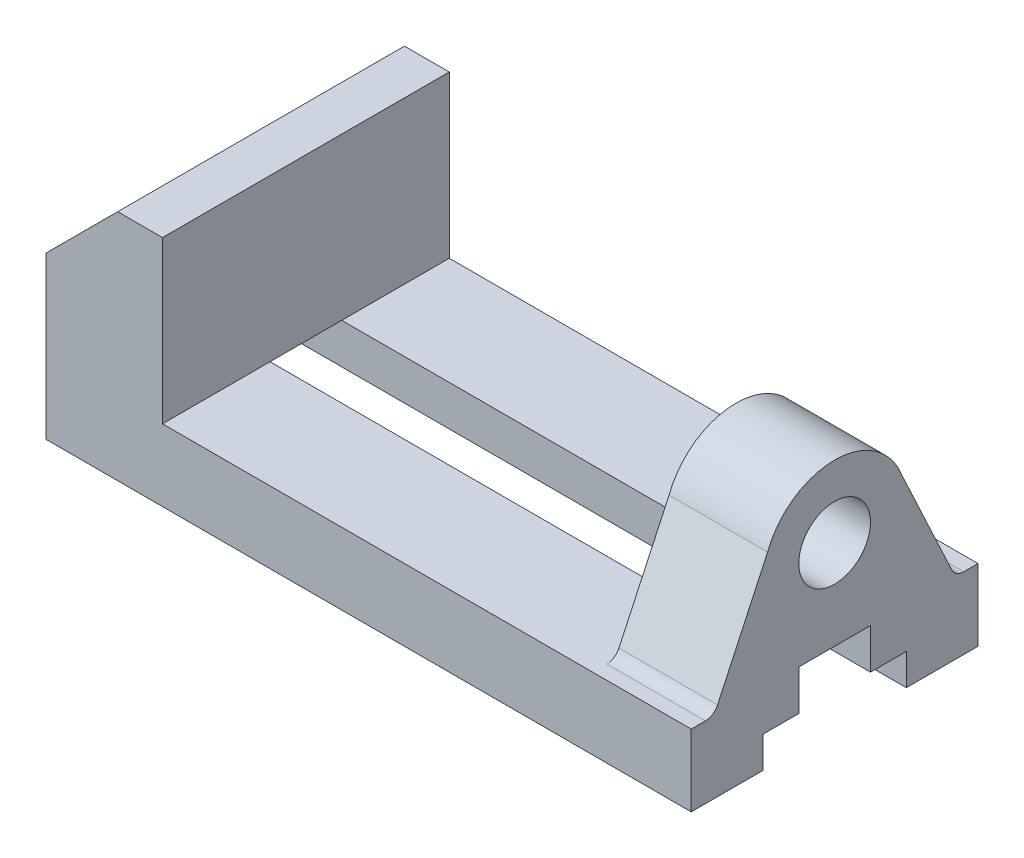
ISO-10303-21;
HEADER;
FILE_DESCRIPTION(('STEP AP214'),'2;1');
FILE_NAME('part.step','',(''),(''),'','','');
FILE_SCHEMA(('AUTOMOTIVE_DESIGN { 1 0 10303 214 1 1 1 1 }'));
ENDSEC;
DATA;
#1=APPLICATION_CONTEXT('core data for automotive mechanical design processes');
#2=APPLICATION_PROTOCOL_DEFINITION('international standard','automotive_design',2000,#1);
#3=PRODUCT_CONTEXT('',#1,'mechanical');
#4=PRODUCT('Part','Part','',(#3));
#5=PRODUCT_RELATED_PRODUCT_CATEGORY('part','',(#4));
#6=PRODUCT_DEFINITION_FORMATION('','',#4);
#7=PRODUCT_DEFINITION_CONTEXT('part definition',#1,'design');
#8=PRODUCT_DEFINITION('design','',#6,#7);
#9=PRODUCT_DEFINITION_SHAPE('','',#8);
#10=(LENGTH_UNIT() NAMED_UNIT(*) SI_UNIT(.MILLI.,.METRE.));
#11=(NAMED_UNIT(*) PLANE_ANGLE_UNIT() SI_UNIT($,.RADIAN.));
#12=(NAMED_UNIT(*) SI_UNIT($,.STERADIAN.) SOLID_ANGLE_UNIT());
#13=UNCERTAINTY_MEASURE_WITH_UNIT(LENGTH_MEASURE(1.E-05),#10,'distance_accuracy_value','');
#14=(GEOMETRIC_REPRESENTATION_CONTEXT(3) GLOBAL_UNCERTAINTY_ASSIGNED_CONTEXT((#13)) GLOBAL_UNIT_ASSIGNED_CONTEXT((#10,
#11,#12)) REPRESENTATION_CONTEXT('',''));
#15=CARTESIAN_POINT('',(0.,0.,0.));
#16=DIRECTION('',(0.,0.,1.));
#17=DIRECTION('',(1.,0.,0.));
#18=AXIS2_PLACEMENT_3D('',#15,#16,#17);
#19=CARTESIAN_POINT('',(50.,52.,-32.));
#20=DIRECTION('',(1.,0.,0.));
#21=DIRECTION('',(0.,0.,-1.));
#22=AXIS2_PLACEMENT_3D('',#19,#20,#21);
#23=PLANE('',#22);
#24=CARTESIAN_POINT('',(50.,36.,0.));
#25=DIRECTION('',(1.,0.,0.));
#26=DIRECTION('',(0.,0.,-1.));
#27=AXIS2_PLACEMENT_3D('',#24,#25,#26);
#28=CIRCLE('',#27,8.);
#29=CARTESIAN_POINT('',(50.,36.,-8.));
#30=VERTEX_POINT('',#29);
#31=EDGE_CURVE('E295',#30,#30,#28,.T.);
#32=ORIENTED_EDGE('',*,*,#31,.T.);
#33=EDGE_LOOP('',(#32));
#34=FACE_BOUND('',#33,.T.);
#35=CARTESIAN_POINT('',(50.,36.,0.));
#36=DIRECTION('',(1.,0.,0.));
#37=DIRECTION('',(0.,0.,-1.));
#38=AXIS2_PLACEMENT_3D('',#35,#36,#37);
#39=CIRCLE('',#38,16.);
#40=CARTESIAN_POINT('',(50.,41.678448811135,-14.9584497558845));
#41=VERTEX_POINT('',#40);
#42=CARTESIAN_POINT('',(50.,41.678448811135,14.9584497558845));
#43=VERTEX_POINT('',#42);
#44=EDGE_CURVE('E319',#41,#43,#39,.T.);
#45=ORIENTED_EDGE('',*,*,#44,.F.);
#46=DIRECTION('',(0.,0.90630778703665,0.4226182617407));
#47=VECTOR('',#46,1.);
#48=CARTESIAN_POINT('',(50.,43.6292145807226,-14.0487927382591));
#49=LINE('',#48,#47);
#50=CARTESIAN_POINT('',(50.,17.7321452147779,-26.1247945073704));
#51=VERTEX_POINT('',#50);
#52=EDGE_CURVE('E301',#51,#41,#49,.T.);
#53=ORIENTED_EDGE('',*,*,#52,.F.);
#54=CARTESIAN_POINT('',(50.,19.,-28.8437178684803));
#55=DIRECTION('',(1.,0.,0.));
#56=DIRECTION('',(0.,0.,-1.));
#57=AXIS2_PLACEMENT_3D('',#54,#55,#56);
#58=CIRCLE('',#57,3.);
#59=CARTESIAN_POINT('',(50.,16.,-28.8437178684803));
#60=VERTEX_POINT('',#59);
#61=EDGE_CURVE('E298',#51,#60,#58,.T.);
#62=ORIENTED_EDGE('',*,*,#61,.T.);
#63=DIRECTION('',(0.,0.,1.));
#64=VECTOR('',#63,1.);
#65=CARTESIAN_POINT('',(50.,16.,-32.));
#66=LINE('',#65,#64);
#67=CARTESIAN_POINT('',(50.,16.,-8.));
#68=VERTEX_POINT('',#67);
#69=EDGE_CURVE('E369',#60,#68,#66,.T.);
#70=ORIENTED_EDGE('',*,*,#69,.T.);
#71=CARTESIAN_POINT('',(50.,16.,8.));
#72=VERTEX_POINT('',#71);
#73=EDGE_CURVE('E372',#68,#72,#66,.T.);
#74=ORIENTED_EDGE('',*,*,#73,.T.);
#75=CARTESIAN_POINT('',(50.,16.,28.8437178684803));
#76=VERTEX_POINT('',#75);
#77=EDGE_CURVE('E368',#72,#76,#66,.T.);
#78=ORIENTED_EDGE('',*,*,#77,.T.);
#79=CARTESIAN_POINT('',(50.,19.,28.8437178684803));
#80=DIRECTION('',(1.,0.,0.));
#81=DIRECTION('',(0.,0.,-1.));
#82=AXIS2_PLACEMENT_3D('',#79,#80,#81);
#83=CIRCLE('',#82,3.);
#84=CARTESIAN_POINT('',(50.,17.7321452147779,26.1247945073703));
#85=VERTEX_POINT('',#84);
#86=EDGE_CURVE('E83',#76,#85,#83,.T.);
#87=ORIENTED_EDGE('',*,*,#86,.T.);
#88=DIRECTION('',(0.,0.90630778703665,-0.4226182617407));
#89=VECTOR('',#88,1.);
#90=CARTESIAN_POINT('',(50.,68.1426367605299,2.61799624822837));
#91=LINE('',#90,#89);
#92=EDGE_CURVE('E12',#85,#43,#91,.T.);
#93=ORIENTED_EDGE('',*,*,#92,.T.);
#94=EDGE_LOOP('',(#45,#53,#62,#70,#74,#78,#87,#93));
#95=FACE_BOUND('',#94,.T.);
#96=ADVANCED_FACE('F75',(#34,#95),#23,.F.);
#97=CARTESIAN_POINT('',(72.,16.,-32.));
#98=DIRECTION('',(-1.,0.,0.));
#99=DIRECTION('',(0.,0.,1.));
#100=AXIS2_PLACEMENT_3D('',#97,#98,#99);
#101=PLANE('',#100);
#102=CARTESIAN_POINT('',(72.,36.,0.));
#103=DIRECTION('',(1.,0.,0.));
#104=DIRECTION('',(0.,0.,-1.));
#105=AXIS2_PLACEMENT_3D('',#102,#103,#104);
#106=CIRCLE('',#105,8.);
#107=CARTESIAN_POINT('',(72.,36.,-8.));
#108=VERTEX_POINT('',#107);
#109=EDGE_CURVE('E289',#108,#108,#106,.T.);
#110=ORIENTED_EDGE('',*,*,#109,.F.);
#111=EDGE_LOOP('',(#110));
#112=FACE_BOUND('',#111,.T.);
#113=DIRECTION('',(0.,0.90630778703665,0.4226182617407));
#114=VECTOR('',#113,1.);
#115=CARTESIAN_POINT('',(72.,13.1734478187763,-28.2505500143372));
#116=LINE('',#115,#114);
#117=CARTESIAN_POINT('',(72.,17.7321452147779,-26.1247945073704));
#118=VERTEX_POINT('',#117);
#119=CARTESIAN_POINT('',(72.,41.678448811135,-14.9584497558845));
#120=VERTEX_POINT('',#119);
#121=EDGE_CURVE('E276',#118,#120,#116,.T.);
#122=ORIENTED_EDGE('',*,*,#121,.T.);
#123=CARTESIAN_POINT('',(72.,36.,0.));
#124=DIRECTION('',(1.,0.,0.));
#125=DIRECTION('',(0.,0.,-1.));
#126=AXIS2_PLACEMENT_3D('',#123,#124,#125);
#127=CIRCLE('',#126,16.);
#128=CARTESIAN_POINT('',(72.,41.678448811135,14.9584497558845));
#129=VERTEX_POINT('',#128);
#130=EDGE_CURVE('E313',#120,#129,#127,.T.);
#131=ORIENTED_EDGE('',*,*,#130,.T.);
#132=DIRECTION('',(0.,0.90630778703665,-0.4226182617407));
#133=VECTOR('',#132,1.);
#134=CARTESIAN_POINT('',(72.,13.1734478187762,28.2505500143372));
#135=LINE('',#134,#133);
#136=CARTESIAN_POINT('',(72.,17.7321452147779,26.1247945073703));
#137=VERTEX_POINT('',#136);
#138=EDGE_CURVE('E310',#137,#129,#135,.T.);
#139=ORIENTED_EDGE('',*,*,#138,.F.);
#140=CARTESIAN_POINT('',(72.,19.,28.8437178684803));
#141=DIRECTION('',(1.,0.,0.));
#142=DIRECTION('',(0.,0.,-1.));
#143=AXIS2_PLACEMENT_3D('',#140,#141,#142);
#144=CIRCLE('',#143,3.);
#145=CARTESIAN_POINT('',(72.,16.,28.8437178684803));
#146=VERTEX_POINT('',#145);
#147=EDGE_CURVE('E307',#146,#137,#144,.T.);
#148=ORIENTED_EDGE('',*,*,#147,.F.);
#149=DIRECTION('',(0.,0.,-1.));
#150=VECTOR('',#149,1.);
#151=CARTESIAN_POINT('',(72.,16.,0.));
#152=LINE('',#151,#150);
#153=CARTESIAN_POINT('',(72.,16.,32.));
#154=VERTEX_POINT('',#153);
#155=EDGE_CURVE('E304',#154,#146,#152,.T.);
#156=ORIENTED_EDGE('',*,*,#155,.F.);
#157=DIRECTION('',(0.,-1.,0.));
#158=VECTOR('',#157,1.);
#159=CARTESIAN_POINT('',(72.,16.,32.));
#160=LINE('',#159,#158);
#161=CARTESIAN_POINT('',(72.,0.,32.));
#162=VERTEX_POINT('',#161);
#163=EDGE_CURVE('E404',#154,#162,#160,.T.);
#164=ORIENTED_EDGE('',*,*,#163,.T.);
#165=DIRECTION('',(0.,0.,-1.));
#166=VECTOR('',#165,1.);
#167=CARTESIAN_POINT('',(72.,0.,-32.));
#168=LINE('',#167,#166);
#169=CARTESIAN_POINT('',(72.,0.,16.));
#170=VERTEX_POINT('',#169);
#171=EDGE_CURVE('E405',#162,#170,#168,.T.);
#172=ORIENTED_EDGE('',*,*,#171,.T.);
#173=DIRECTION('',(0.,-1.,0.));
#174=VECTOR('',#173,1.);
#175=CARTESIAN_POINT('',(72.,16.,16.));
#176=LINE('',#175,#174);
#177=CARTESIAN_POINT('',(72.,7.,16.));
#178=VERTEX_POINT('',#177);
#179=EDGE_CURVE('E90',#178,#170,#176,.T.);
#180=ORIENTED_EDGE('',*,*,#179,.F.);
#181=DIRECTION('',(0.,0.,1.));
#182=VECTOR('',#181,1.);
#183=CARTESIAN_POINT('',(72.,7.,-32.));
#184=LINE('',#183,#182);
#185=CARTESIAN_POINT('',(72.,7.,8.));
#186=VERTEX_POINT('',#185);
#187=EDGE_CURVE('E431',#186,#178,#184,.T.);
#188=ORIENTED_EDGE('',*,*,#187,.F.);
#189=DIRECTION('',(0.,-1.,0.));
#190=VECTOR('',#189,1.);
#191=CARTESIAN_POINT('',(72.,16.,8.));
#192=LINE('',#191,#190);
#193=CARTESIAN_POINT('',(72.,16.,8.));
#194=VERTEX_POINT('',#193);
#195=EDGE_CURVE('E429',#194,#186,#192,.T.);
#196=ORIENTED_EDGE('',*,*,#195,.F.);
#197=DIRECTION('',(0.,0.,1.));
#198=VECTOR('',#197,1.);
#199=CARTESIAN_POINT('',(72.,16.,-32.));
#200=LINE('',#199,#198);
#201=CARTESIAN_POINT('',(72.,16.,-8.));
#202=VERTEX_POINT('',#201);
#203=EDGE_CURVE('E363',#202,#194,#200,.T.);
#204=ORIENTED_EDGE('',*,*,#203,.F.);
#205=DIRECTION('',(0.,1.,0.));
#206=VECTOR('',#205,1.);
#207=CARTESIAN_POINT('',(72.,16.,-8.));
#208=LINE('',#207,#206);
#209=CARTESIAN_POINT('',(72.,7.,-8.));
#210=VERTEX_POINT('',#209);
#211=EDGE_CURVE('E427',#210,#202,#208,.T.);
#212=ORIENTED_EDGE('',*,*,#211,.F.);
#213=DIRECTION('',(0.,0.,1.));
#214=VECTOR('',#213,1.);
#215=CARTESIAN_POINT('',(72.,7.,-32.));
#216=LINE('',#215,#214);
#217=CARTESIAN_POINT('',(72.,7.,-16.));
#218=VERTEX_POINT('',#217);
#219=EDGE_CURVE('E425',#218,#210,#216,.T.);
#220=ORIENTED_EDGE('',*,*,#219,.F.);
#221=DIRECTION('',(0.,1.,0.));
#222=VECTOR('',#221,1.);
#223=CARTESIAN_POINT('',(72.,16.,-16.));
#224=LINE('',#223,#222);
#225=CARTESIAN_POINT('',(72.,0.,-16.));
#226=VERTEX_POINT('',#225);
#227=EDGE_CURVE('E366',#226,#218,#224,.T.);
#228=ORIENTED_EDGE('',*,*,#227,.F.);
#229=CARTESIAN_POINT('',(72.,0.,-32.));
#230=VERTEX_POINT('',#229);
#231=EDGE_CURVE('E398',#226,#230,#168,.T.);
#232=ORIENTED_EDGE('',*,*,#231,.T.);
#233=DIRECTION('',(0.,-1.,0.));
#234=VECTOR('',#233,1.);
#235=CARTESIAN_POINT('',(72.,16.,-32.));
#236=LINE('',#235,#234);
#237=CARTESIAN_POINT('',(72.,16.,-32.));
#238=VERTEX_POINT('',#237);
#239=EDGE_CURVE('E423',#238,#230,#236,.T.);
#240=ORIENTED_EDGE('',*,*,#239,.F.);
#241=DIRECTION('',(0.,0.,-1.));
#242=VECTOR('',#241,1.);
#243=CARTESIAN_POINT('',(72.,16.,0.));
#244=LINE('',#243,#242);
#245=CARTESIAN_POINT('',(72.,16.,-28.8437178684803));
#246=VERTEX_POINT('',#245);
#247=EDGE_CURVE('E282',#246,#238,#244,.T.);
#248=ORIENTED_EDGE('',*,*,#247,.F.);
#249=CARTESIAN_POINT('',(72.,19.,-28.8437178684803));
#250=DIRECTION('',(1.,0.,0.));
#251=DIRECTION('',(0.,0.,-1.));
#252=AXIS2_PLACEMENT_3D('',#249,#250,#251);
#253=CIRCLE('',#252,3.);
#254=EDGE_CURVE('E279',#118,#246,#253,.T.);
#255=ORIENTED_EDGE('',*,*,#254,.F.);
#256=EDGE_LOOP('',(#122,#131,#139,#148,#156,#164,#172,#180,#188,#196,#204,#212,#220,#228,#232,
#240,#248,#255));
#257=FACE_BOUND('',#256,.T.);
#258=ADVANCED_FACE('F77',(#112,#257),#101,.F.);
#259=CARTESIAN_POINT('',(0.,16.,0.));
#260=DIRECTION('',(0.,1.,0.));
#261=DIRECTION('',(0.,0.,1.));
#262=AXIS2_PLACEMENT_3D('',#259,#260,#261);
#263=PLANE('',#262);
#264=DIRECTION('',(1.,0.,0.));
#265=VECTOR('',#264,1.);
#266=CARTESIAN_POINT('',(36.,16.,28.8437178684803));
#267=LINE('',#266,#265);
#268=EDGE_CURVE('E316',#76,#146,#267,.T.);
#269=ORIENTED_EDGE('',*,*,#268,.F.);
#270=ORIENTED_EDGE('',*,*,#77,.F.);
#271=DIRECTION('',(1.,0.,0.));
#272=VECTOR('',#271,1.);
#273=CARTESIAN_POINT('',(-72.,16.,8.));
#274=LINE('',#273,#272);
#275=CARTESIAN_POINT('',(-46.,16.,8.));
#276=VERTEX_POINT('',#275);
#277=EDGE_CURVE('E98',#276,#72,#274,.T.);
#278=ORIENTED_EDGE('',*,*,#277,.F.);
#279=DIRECTION('',(0.,0.,-1.));
#280=VECTOR('',#279,1.);
#281=CARTESIAN_POINT('',(-46.,16.,-32.));
#282=LINE('',#281,#280);
#283=CARTESIAN_POINT('',(-46.,16.,32.));
#284=VERTEX_POINT('',#283);
#285=EDGE_CURVE('E385',#284,#276,#282,.T.);
#286=ORIENTED_EDGE('',*,*,#285,.F.);
#287=DIRECTION('',(1.,0.,0.));
#288=VECTOR('',#287,1.);
#289=CARTESIAN_POINT('',(-72.,16.,32.));
#290=LINE('',#289,#288);
#291=EDGE_CURVE('E401',#284,#154,#290,.T.);
#292=ORIENTED_EDGE('',*,*,#291,.T.);
#293=ORIENTED_EDGE('',*,*,#155,.T.);
#294=EDGE_LOOP('',(#269,#270,#278,#286,#292,#293));
#295=FACE_BOUND('',#294,.T.);
#296=ADVANCED_FACE('F442',(#295),#263,.T.);
#297=ORIENTED_EDGE('',*,*,#69,.F.);
#298=DIRECTION('',(1.,0.,0.));
#299=VECTOR('',#298,1.);
#300=CARTESIAN_POINT('',(36.,16.,-28.8437178684803));
#301=LINE('',#300,#299);
#302=EDGE_CURVE('E290',#60,#246,#301,.T.);
#303=ORIENTED_EDGE('',*,*,#302,.T.);
#304=ORIENTED_EDGE('',*,*,#247,.T.);
#305=DIRECTION('',(-1.,0.,0.));
#306=VECTOR('',#305,1.);
#307=CARTESIAN_POINT('',(-72.,16.,-32.));
#308=LINE('',#307,#306);
#309=CARTESIAN_POINT('',(-46.,16.,-32.));
#310=VERTEX_POINT('',#309);
#311=EDGE_CURVE('E399',#238,#310,#308,.T.);
#312=ORIENTED_EDGE('',*,*,#311,.T.);
#313=CARTESIAN_POINT('',(-46.,16.,-8.));
#314=VERTEX_POINT('',#313);
#315=EDGE_CURVE('E381',#314,#310,#282,.T.);
#316=ORIENTED_EDGE('',*,*,#315,.F.);
#317=DIRECTION('',(1.,0.,0.));
#318=VECTOR('',#317,1.);
#319=CARTESIAN_POINT('',(-72.,16.,-8.));
#320=LINE('',#319,#318);
#321=EDGE_CURVE('E355',#314,#68,#320,.T.);
#322=ORIENTED_EDGE('',*,*,#321,.T.);
#323=EDGE_LOOP('',(#297,#303,#304,#312,#316,#322));
#324=FACE_BOUND('',#323,.T.);
#325=ADVANCED_FACE('F468',(#324),#263,.T.);
#326=CARTESIAN_POINT('',(-72.,16.,-32.));
#327=DIRECTION('',(1.,0.,0.));
#328=DIRECTION('',(0.,0.,-1.));
#329=AXIS2_PLACEMENT_3D('',#326,#327,#328);
#330=PLANE('',#329);
#331=DIRECTION('',(0.,-1.,0.));
#332=VECTOR('',#331,1.);
#333=CARTESIAN_POINT('',(-72.,0.,-16.));
#334=LINE('',#333,#332);
#335=CARTESIAN_POINT('',(-72.,7.,-16.));
#336=VERTEX_POINT('',#335);
#337=CARTESIAN_POINT('',(-72.,0.,-16.));
#338=VERTEX_POINT('',#337);
#339=EDGE_CURVE('E324',#336,#338,#334,.T.);
#340=ORIENTED_EDGE('',*,*,#339,.F.);
#341=DIRECTION('',(0.,0.,-1.));
#342=VECTOR('',#341,1.);
#343=CARTESIAN_POINT('',(-72.,7.,0.));
#344=LINE('',#343,#342);
#345=CARTESIAN_POINT('',(-72.,7.,-8.));
#346=VERTEX_POINT('',#345);
#347=EDGE_CURVE('E326',#346,#336,#344,.T.);
#348=ORIENTED_EDGE('',*,*,#347,.F.);
#349=DIRECTION('',(0.,-1.,0.));
#350=VECTOR('',#349,1.);
#351=CARTESIAN_POINT('',(-72.,0.,-8.));
#352=LINE('',#351,#350);
#353=CARTESIAN_POINT('',(-72.,16.,-8.));
#354=VERTEX_POINT('',#353);
#355=EDGE_CURVE('E328',#354,#346,#352,.T.);
#356=ORIENTED_EDGE('',*,*,#355,.F.);
#357=DIRECTION('',(0.,0.,-1.));
#358=VECTOR('',#357,1.);
#359=CARTESIAN_POINT('',(-72.,16.,0.));
#360=LINE('',#359,#358);
#361=CARTESIAN_POINT('',(-72.,16.,8.));
#362=VERTEX_POINT('',#361);
#363=EDGE_CURVE('E330',#362,#354,#360,.T.);
#364=ORIENTED_EDGE('',*,*,#363,.F.);
#365=DIRECTION('',(0.,1.,0.));
#366=VECTOR('',#365,1.);
#367=CARTESIAN_POINT('',(-72.,0.,8.));
#368=LINE('',#367,#366);
#369=CARTESIAN_POINT('',(-72.,7.,8.));
#370=VERTEX_POINT('',#369);
#371=EDGE_CURVE('E332',#370,#362,#368,.T.);
#372=ORIENTED_EDGE('',*,*,#371,.F.);
#373=DIRECTION('',(0.,0.,-1.));
#374=VECTOR('',#373,1.);
#375=CARTESIAN_POINT('',(-72.,7.,0.));
#376=LINE('',#375,#374);
#377=CARTESIAN_POINT('',(-72.,7.,16.));
#378=VERTEX_POINT('',#377);
#379=EDGE_CURVE('E334',#378,#370,#376,.T.);
#380=ORIENTED_EDGE('',*,*,#379,.F.);
#381=DIRECTION('',(0.,1.,0.));
#382=VECTOR('',#381,1.);
#383=CARTESIAN_POINT('',(-72.,0.,16.));
#384=LINE('',#383,#382);
#385=CARTESIAN_POINT('',(-72.,0.,16.));
#386=VERTEX_POINT('',#385);
#387=EDGE_CURVE('E336',#386,#378,#384,.T.);
#388=ORIENTED_EDGE('',*,*,#387,.F.);
#389=DIRECTION('',(0.,0.,1.));
#390=VECTOR('',#389,1.);
#391=CARTESIAN_POINT('',(-72.,0.,-32.));
#392=LINE('',#391,#390);
#393=CARTESIAN_POINT('',(-72.,0.,32.));
#394=VERTEX_POINT('',#393);
#395=EDGE_CURVE('E411',#386,#394,#392,.T.);
#396=ORIENTED_EDGE('',*,*,#395,.T.);
#397=DIRECTION('',(0.,-1.,0.));
#398=VECTOR('',#397,1.);
#399=CARTESIAN_POINT('',(-72.,16.,32.));
#400=LINE('',#399,#398);
#401=CARTESIAN_POINT('',(-72.,35.9999999999997,32.));
#402=VERTEX_POINT('',#401);
#403=EDGE_CURVE('E418',#402,#394,#400,.T.);
#404=ORIENTED_EDGE('',*,*,#403,.F.);
#405=DIRECTION('',(0.,0.,1.));
#406=VECTOR('',#405,1.);
#407=CARTESIAN_POINT('',(-72.,35.9999999999997,-32.));
#408=LINE('',#407,#406);
#409=CARTESIAN_POINT('',(-72.,35.9999999999997,-32.));
#410=VERTEX_POINT('',#409);
#411=EDGE_CURVE('E375',#410,#402,#408,.T.);
#412=ORIENTED_EDGE('',*,*,#411,.F.);
#413=DIRECTION('',(0.,-1.,0.));
#414=VECTOR('',#413,1.);
#415=CARTESIAN_POINT('',(-72.,16.,-32.));
#416=LINE('',#415,#414);
#417=CARTESIAN_POINT('',(-72.,0.,-32.));
#418=VERTEX_POINT('',#417);
#419=EDGE_CURVE('E421',#410,#418,#416,.T.);
#420=ORIENTED_EDGE('',*,*,#419,.T.);
#421=EDGE_CURVE('E412',#418,#338,#392,.T.);
#422=ORIENTED_EDGE('',*,*,#421,.T.);
#423=EDGE_LOOP('',(#340,#348,#356,#364,#372,#380,#388,#396,#404,#412,#420,#422));
#424=FACE_BOUND('',#423,.T.);
#425=ADVANCED_FACE('F493',(#424),#330,.F.);
#426=CARTESIAN_POINT('',(0.,0.,0.));
#427=DIRECTION('',(0.,1.,0.));
#428=DIRECTION('',(0.,0.,1.));
#429=AXIS2_PLACEMENT_3D('',#426,#427,#428);
#430=PLANE('',#429);
#431=CARTESIAN_POINT('',(36.,0.,-24.9579137076794));
#432=DIRECTION('',(0.,-1.,0.));
#433=DIRECTION('',(0.,0.,-1.));
#434=AXIS2_PLACEMENT_3D('',#431,#432,#433);
#435=CIRCLE('',#434,6.);
#436=CARTESIAN_POINT('',(36.,0.,-30.9579137076794));
#437=VERTEX_POINT('',#436);
#438=EDGE_CURVE('E264',#437,#437,#435,.T.);
#439=ORIENTED_EDGE('',*,*,#438,.F.);
#440=EDGE_LOOP('',(#439));
#441=FACE_BOUND('',#440,.T.);
#442=CARTESIAN_POINT('',(-34.,0.,-24.9579137076794));
#443=DIRECTION('',(0.,-1.,0.));
#444=DIRECTION('',(0.,0.,-1.));
#445=AXIS2_PLACEMENT_3D('',#442,#443,#444);
#446=CIRCLE('',#445,6.);
#447=CARTESIAN_POINT('',(-34.,0.,-30.9579137076794));
#448=VERTEX_POINT('',#447);
#449=EDGE_CURVE('E270',#448,#448,#446,.T.);
#450=ORIENTED_EDGE('',*,*,#449,.F.);
#451=EDGE_LOOP('',(#450));
#452=FACE_BOUND('',#451,.T.);
#453=DIRECTION('',(1.,0.,0.));
#454=VECTOR('',#453,1.);
#455=CARTESIAN_POINT('',(-72.,0.,-16.));
#456=LINE('',#455,#454);
#457=EDGE_CURVE('E339',#338,#226,#456,.T.);
#458=ORIENTED_EDGE('',*,*,#457,.F.);
#459=ORIENTED_EDGE('',*,*,#421,.F.);
#460=DIRECTION('',(-1.,0.,0.));
#461=VECTOR('',#460,1.);
#462=CARTESIAN_POINT('',(-72.,0.,-32.));
#463=LINE('',#462,#461);
#464=EDGE_CURVE('E408',#230,#418,#463,.T.);
#465=ORIENTED_EDGE('',*,*,#464,.F.);
#466=ORIENTED_EDGE('',*,*,#231,.F.);
#467=EDGE_LOOP('',(#458,#459,#465,#466));
#468=FACE_BOUND('',#467,.T.);
#469=ADVANCED_FACE('F547',(#441,#452,#468),#430,.F.);
#470=CARTESIAN_POINT('',(-34.,0.,23.5518340621767));
#471=DIRECTION('',(0.,-1.,0.));
#472=DIRECTION('',(0.,0.,-1.));
#473=AXIS2_PLACEMENT_3D('',#470,#471,#472);
#474=CIRCLE('',#473,6.);
#475=CARTESIAN_POINT('',(-34.,0.,17.5518340621767));
#476=VERTEX_POINT('',#475);
#477=EDGE_CURVE('E254',#476,#476,#474,.T.);
#478=ORIENTED_EDGE('',*,*,#477,.F.);
#479=EDGE_LOOP('',(#478));
#480=FACE_BOUND('',#479,.T.);
#481=CARTESIAN_POINT('',(36.,0.,23.5518340621767));
#482=DIRECTION('',(0.,-1.,0.));
#483=DIRECTION('',(0.,0.,-1.));
#484=AXIS2_PLACEMENT_3D('',#481,#482,#483);
#485=CIRCLE('',#484,6.);
#486=CARTESIAN_POINT('',(36.,0.,17.5518340621767));
#487=VERTEX_POINT('',#486);
#488=EDGE_CURVE('E253',#487,#487,#485,.T.);
#489=ORIENTED_EDGE('',*,*,#488,.F.);
#490=EDGE_LOOP('',(#489));
#491=FACE_BOUND('',#490,.T.);
#492=DIRECTION('',(1.,0.,0.));
#493=VECTOR('',#492,1.);
#494=CARTESIAN_POINT('',(-72.,0.,16.));
#495=LINE('',#494,#493);
#496=EDGE_CURVE('E342',#386,#170,#495,.T.);
#497=ORIENTED_EDGE('',*,*,#496,.T.);
#498=ORIENTED_EDGE('',*,*,#171,.F.);
#499=DIRECTION('',(1.,0.,0.));
#500=VECTOR('',#499,1.);
#501=CARTESIAN_POINT('',(-72.,0.,32.));
#502=LINE('',#501,#500);
#503=EDGE_CURVE('E402',#394,#162,#502,.T.);
#504=ORIENTED_EDGE('',*,*,#503,.F.);
#505=ORIENTED_EDGE('',*,*,#395,.F.);
#506=EDGE_LOOP('',(#497,#498,#504,#505));
#507=FACE_BOUND('',#506,.T.);
#508=ADVANCED_FACE('F511',(#480,#491,#507),#430,.F.);
#509=CARTESIAN_POINT('',(-72.,16.,-32.));
#510=DIRECTION('',(0.,0.,1.));
#511=DIRECTION('',(1.,0.,0.));
#512=AXIS2_PLACEMENT_3D('',#509,#510,#511);
#513=PLANE('',#512);
#514=ORIENTED_EDGE('',*,*,#311,.F.);
#515=ORIENTED_EDGE('',*,*,#239,.T.);
#516=ORIENTED_EDGE('',*,*,#464,.T.);
#517=ORIENTED_EDGE('',*,*,#419,.F.);
#518=DIRECTION('',(-0.707106781186542,-0.707106781186553,0.));
#519=VECTOR('',#518,1.);
#520=CARTESIAN_POINT('',(-54.0000000000004,53.9999999999996,-32.));
#521=LINE('',#520,#519);
#522=CARTESIAN_POINT('',(-56.,52.,-32.));
#523=VERTEX_POINT('',#522);
#524=EDGE_CURVE('E371',#523,#410,#521,.T.);
#525=ORIENTED_EDGE('',*,*,#524,.F.);
#526=DIRECTION('',(-1.,0.,0.));
#527=VECTOR('',#526,1.);
#528=CARTESIAN_POINT('',(-72.,52.,-32.));
#529=LINE('',#528,#527);
#530=CARTESIAN_POINT('',(-46.,52.,-32.));
#531=VERTEX_POINT('',#530);
#532=EDGE_CURVE('E387',#531,#523,#529,.T.);
#533=ORIENTED_EDGE('',*,*,#532,.F.);
#534=DIRECTION('',(0.,-1.,0.));
#535=VECTOR('',#534,1.);
#536=CARTESIAN_POINT('',(-46.,52.,-32.));
#537=LINE('',#536,#535);
#538=EDGE_CURVE('E390',#531,#310,#537,.T.);
#539=ORIENTED_EDGE('',*,*,#538,.T.);
#540=EDGE_LOOP('',(#514,#515,#516,#517,#525,#533,#539));
#541=FACE_BOUND('',#540,.T.);
#542=ADVANCED_FACE('F553',(#541),#513,.F.);
#543=CARTESIAN_POINT('',(-72.,16.,32.));
#544=DIRECTION('',(0.,0.,-1.));
#545=DIRECTION('',(-1.,0.,0.));
#546=AXIS2_PLACEMENT_3D('',#543,#544,#545);
#547=PLANE('',#546);
#548=ORIENTED_EDGE('',*,*,#163,.F.);
#549=ORIENTED_EDGE('',*,*,#291,.F.);
#550=DIRECTION('',(0.,-1.,0.));
#551=VECTOR('',#550,1.);
#552=CARTESIAN_POINT('',(-46.,52.,32.));
#553=LINE('',#552,#551);
#554=CARTESIAN_POINT('',(-46.,52.,32.));
#555=VERTEX_POINT('',#554);
#556=EDGE_CURVE('E395',#555,#284,#553,.T.);
#557=ORIENTED_EDGE('',*,*,#556,.F.);
#558=DIRECTION('',(1.,0.,0.));
#559=VECTOR('',#558,1.);
#560=CARTESIAN_POINT('',(-72.,52.,32.));
#561=LINE('',#560,#559);
#562=CARTESIAN_POINT('',(-56.,52.,32.));
#563=VERTEX_POINT('',#562);
#564=EDGE_CURVE('E382',#563,#555,#561,.T.);
#565=ORIENTED_EDGE('',*,*,#564,.F.);
#566=DIRECTION('',(0.707106781186542,0.707106781186553,0.));
#567=VECTOR('',#566,1.);
#568=CARTESIAN_POINT('',(-81.9999999999999,25.9999999999997,32.));
#569=LINE('',#568,#567);
#570=EDGE_CURVE('E377',#402,#563,#569,.T.);
#571=ORIENTED_EDGE('',*,*,#570,.F.);
#572=ORIENTED_EDGE('',*,*,#403,.T.);
#573=ORIENTED_EDGE('',*,*,#503,.T.);
#574=EDGE_LOOP('',(#548,#549,#557,#565,#571,#572,#573));
#575=FACE_BOUND('',#574,.T.);
#576=ADVANCED_FACE('F506',(#575),#547,.F.);
#577=CARTESIAN_POINT('',(0.,52.,0.));
#578=DIRECTION('',(0.,1.,0.));
#579=DIRECTION('',(0.,0.,1.));
#580=AXIS2_PLACEMENT_3D('',#577,#578,#579);
#581=PLANE('',#580);
#582=ORIENTED_EDGE('',*,*,#532,.T.);
#583=DIRECTION('',(0.,0.,1.));
#584=VECTOR('',#583,1.);
#585=CARTESIAN_POINT('',(-56.,52.,-32.));
#586=LINE('',#585,#584);
#587=EDGE_CURVE('E374',#523,#563,#586,.T.);
#588=ORIENTED_EDGE('',*,*,#587,.T.);
#589=ORIENTED_EDGE('',*,*,#564,.T.);
#590=DIRECTION('',(0.,0.,-1.));
#591=VECTOR('',#590,1.);
#592=CARTESIAN_POINT('',(-46.,52.,-32.));
#593=LINE('',#592,#591);
#594=EDGE_CURVE('E384',#555,#531,#593,.T.);
#595=ORIENTED_EDGE('',*,*,#594,.T.);
#596=EDGE_LOOP('',(#582,#588,#589,#595));
#597=FACE_BOUND('',#596,.T.);
#598=ADVANCED_FACE('F539',(#597),#581,.T.);
#599=CARTESIAN_POINT('',(-46.,52.,-32.));
#600=DIRECTION('',(-1.,0.,0.));
#601=DIRECTION('',(0.,0.,1.));
#602=AXIS2_PLACEMENT_3D('',#599,#600,#601);
#603=PLANE('',#602);
#604=ORIENTED_EDGE('',*,*,#285,.T.);
#605=DIRECTION('',(0.,0.,1.));
#606=VECTOR('',#605,1.);
#607=CARTESIAN_POINT('',(-46.,16.,-32.));
#608=LINE('',#607,#606);
#609=EDGE_CURVE('E341',#314,#276,#608,.T.);
#610=ORIENTED_EDGE('',*,*,#609,.F.);
#611=ORIENTED_EDGE('',*,*,#315,.T.);
#612=ORIENTED_EDGE('',*,*,#538,.F.);
#613=ORIENTED_EDGE('',*,*,#594,.F.);
#614=ORIENTED_EDGE('',*,*,#556,.T.);
#615=EDGE_LOOP('',(#604,#610,#611,#612,#613,#614));
#616=FACE_BOUND('',#615,.T.);
#617=ADVANCED_FACE('F501',(#616),#603,.F.);
#618=CARTESIAN_POINT('',(-54.0000000000004,53.9999999999996,-32.));
#619=DIRECTION('',(-0.707106781186553,0.707106781186542,0.));
#620=DIRECTION('',(-0.707106781186542,-0.707106781186553,0.));
#621=AXIS2_PLACEMENT_3D('',#618,#619,#620);
#622=PLANE('',#621);
#623=ORIENTED_EDGE('',*,*,#570,.T.);
#624=ORIENTED_EDGE('',*,*,#587,.F.);
#625=ORIENTED_EDGE('',*,*,#524,.T.);
#626=ORIENTED_EDGE('',*,*,#411,.T.);
#627=EDGE_LOOP('',(#623,#624,#625,#626));
#628=FACE_BOUND('',#627,.T.);
#629=ADVANCED_FACE('F535',(#628),#622,.T.);
#630=CARTESIAN_POINT('',(-72.,7.,0.));
#631=DIRECTION('',(0.,-1.,0.));
#632=DIRECTION('',(0.,0.,-1.));
#633=AXIS2_PLACEMENT_3D('',#630,#631,#632);
#634=PLANE('',#633);
#635=ORIENTED_EDGE('',*,*,#187,.T.);
#636=DIRECTION('',(1.,0.,0.));
#637=VECTOR('',#636,1.);
#638=CARTESIAN_POINT('',(-72.,7.,16.));
#639=LINE('',#638,#637);
#640=EDGE_CURVE('E344',#378,#178,#639,.T.);
#641=ORIENTED_EDGE('',*,*,#640,.F.);
#642=ORIENTED_EDGE('',*,*,#379,.T.);
#643=DIRECTION('',(1.,0.,0.));
#644=VECTOR('',#643,1.);
#645=CARTESIAN_POINT('',(-72.,7.,8.));
#646=LINE('',#645,#644);
#647=EDGE_CURVE('E346',#370,#186,#646,.T.);
#648=ORIENTED_EDGE('',*,*,#647,.T.);
#649=EDGE_LOOP('',(#635,#641,#642,#648));
#650=FACE_BOUND('',#649,.T.);
#651=ADVANCED_FACE('F487',(#650),#634,.T.);
#652=CARTESIAN_POINT('',(-72.,0.,8.));
#653=DIRECTION('',(0.,0.,-1.));
#654=DIRECTION('',(-1.,0.,0.));
#655=AXIS2_PLACEMENT_3D('',#652,#653,#654);
#656=PLANE('',#655);
#657=ORIENTED_EDGE('',*,*,#195,.T.);
#658=ORIENTED_EDGE('',*,*,#647,.F.);
#659=ORIENTED_EDGE('',*,*,#371,.T.);
#660=EDGE_CURVE('E349',#362,#276,#274,.T.);
#661=ORIENTED_EDGE('',*,*,#660,.T.);
#662=ORIENTED_EDGE('',*,*,#277,.T.);
#663=EDGE_CURVE('E351',#72,#194,#274,.T.);
#664=ORIENTED_EDGE('',*,*,#663,.T.);
#665=EDGE_LOOP('',(#657,#658,#659,#661,#662,#664));
#666=FACE_BOUND('',#665,.T.);
#667=ADVANCED_FACE('F484',(#666),#656,.T.);
#668=CARTESIAN_POINT('',(-72.,0.,-8.));
#669=DIRECTION('',(0.,0.,1.));
#670=DIRECTION('',(0.,-1.,0.));
#671=AXIS2_PLACEMENT_3D('',#668,#669,#670);
#672=PLANE('',#671);
#673=ORIENTED_EDGE('',*,*,#211,.T.);
#674=EDGE_CURVE('E356',#68,#202,#320,.T.);
#675=ORIENTED_EDGE('',*,*,#674,.F.);
#676=ORIENTED_EDGE('',*,*,#321,.F.);
#677=EDGE_CURVE('E352',#354,#314,#320,.T.);
#678=ORIENTED_EDGE('',*,*,#677,.F.);
#679=ORIENTED_EDGE('',*,*,#355,.T.);
#680=DIRECTION('',(1.,0.,0.));
#681=VECTOR('',#680,1.);
#682=CARTESIAN_POINT('',(-72.,7.,-8.));
#683=LINE('',#682,#681);
#684=EDGE_CURVE('E357',#346,#210,#683,.T.);
#685=ORIENTED_EDGE('',*,*,#684,.T.);
#686=EDGE_LOOP('',(#673,#675,#676,#678,#679,#685));
#687=FACE_BOUND('',#686,.T.);
#688=ADVANCED_FACE('F579',(#687),#672,.T.);
#689=CARTESIAN_POINT('',(-72.,7.,0.));
#690=DIRECTION('',(0.,-1.,0.));
#691=DIRECTION('',(0.,0.,-1.));
#692=AXIS2_PLACEMENT_3D('',#689,#690,#691);
#693=PLANE('',#692);
#694=ORIENTED_EDGE('',*,*,#219,.T.);
#695=ORIENTED_EDGE('',*,*,#684,.F.);
#696=ORIENTED_EDGE('',*,*,#347,.T.);
#697=DIRECTION('',(1.,0.,0.));
#698=VECTOR('',#697,1.);
#699=CARTESIAN_POINT('',(-72.,7.,-16.));
#700=LINE('',#699,#698);
#701=EDGE_CURVE('E338',#336,#218,#700,.T.);
#702=ORIENTED_EDGE('',*,*,#701,.T.);
#703=EDGE_LOOP('',(#694,#695,#696,#702));
#704=FACE_BOUND('',#703,.T.);
#705=ADVANCED_FACE('F521',(#704),#693,.T.);
#706=CARTESIAN_POINT('',(-72.,0.,-16.));
#707=DIRECTION('',(0.,0.,1.));
#708=DIRECTION('',(1.,0.,0.));
#709=AXIS2_PLACEMENT_3D('',#706,#707,#708);
#710=PLANE('',#709);
#711=ORIENTED_EDGE('',*,*,#227,.T.);
#712=ORIENTED_EDGE('',*,*,#701,.F.);
#713=ORIENTED_EDGE('',*,*,#339,.T.);
#714=ORIENTED_EDGE('',*,*,#457,.T.);
#715=EDGE_LOOP('',(#711,#712,#713,#714));
#716=FACE_BOUND('',#715,.T.);
#717=ADVANCED_FACE('F514',(#716),#710,.T.);
#718=CARTESIAN_POINT('',(-72.,0.,16.));
#719=DIRECTION('',(0.,0.,-1.));
#720=DIRECTION('',(-1.,0.,0.));
#721=AXIS2_PLACEMENT_3D('',#718,#719,#720);
#722=PLANE('',#721);
#723=ORIENTED_EDGE('',*,*,#179,.T.);
#724=ORIENTED_EDGE('',*,*,#496,.F.);
#725=ORIENTED_EDGE('',*,*,#387,.T.);
#726=ORIENTED_EDGE('',*,*,#640,.T.);
#727=EDGE_LOOP('',(#723,#724,#725,#726));
#728=FACE_BOUND('',#727,.T.);
#729=ADVANCED_FACE('F512',(#728),#722,.T.);
#730=CARTESIAN_POINT('',(-72.,16.,0.));
#731=DIRECTION('',(0.,-1.,0.));
#732=DIRECTION('',(0.,0.,-1.));
#733=AXIS2_PLACEMENT_3D('',#730,#731,#732);
#734=PLANE('',#733);
#735=ORIENTED_EDGE('',*,*,#203,.T.);
#736=ORIENTED_EDGE('',*,*,#663,.F.);
#737=ORIENTED_EDGE('',*,*,#73,.F.);
#738=ORIENTED_EDGE('',*,*,#674,.T.);
#739=EDGE_LOOP('',(#735,#736,#737,#738));
#740=FACE_BOUND('',#739,.T.);
#741=ADVANCED_FACE('F478',(#740),#734,.T.);
#742=ORIENTED_EDGE('',*,*,#609,.T.);
#743=ORIENTED_EDGE('',*,*,#660,.F.);
#744=ORIENTED_EDGE('',*,*,#363,.T.);
#745=ORIENTED_EDGE('',*,*,#677,.T.);
#746=EDGE_LOOP('',(#742,#743,#744,#745));
#747=FACE_BOUND('',#746,.T.);
#748=ADVANCED_FACE('F499',(#747),#734,.T.);
#749=CARTESIAN_POINT('',(36.,13.1734478187762,28.2505500143372));
#750=DIRECTION('',(0.,-0.4226182617407,-0.90630778703665));
#751=DIRECTION('',(0.,0.90630778703665,-0.4226182617407));
#752=AXIS2_PLACEMENT_3D('',#749,#750,#751);
#753=PLANE('',#752);
#754=DIRECTION('',(1.,0.,0.));
#755=VECTOR('',#754,1.);
#756=CARTESIAN_POINT('',(36.,17.7321452147779,26.1247945073703));
#757=LINE('',#756,#755);
#758=EDGE_CURVE('E320',#85,#137,#757,.T.);
#759=ORIENTED_EDGE('',*,*,#758,.T.);
#760=ORIENTED_EDGE('',*,*,#138,.T.);
#761=DIRECTION('',(1.,0.,0.));
#762=VECTOR('',#761,1.);
#763=CARTESIAN_POINT('',(36.,41.678448811135,14.9584497558845));
#764=LINE('',#763,#762);
#765=EDGE_CURVE('E317',#43,#129,#764,.T.);
#766=ORIENTED_EDGE('',*,*,#765,.F.);
#767=ORIENTED_EDGE('',*,*,#92,.F.);
#768=EDGE_LOOP('',(#759,#760,#766,#767));
#769=FACE_BOUND('',#768,.T.);
#770=ADVANCED_FACE('F451',(#769),#753,.F.);
#771=CARTESIAN_POINT('',(36.,19.,28.8437178684803));
#772=DIRECTION('',(1.,0.,0.));
#773=DIRECTION('',(0.,0.,-1.));
#774=AXIS2_PLACEMENT_3D('',#771,#772,#773);
#775=CYLINDRICAL_SURFACE('',#774,3.);
#776=ORIENTED_EDGE('',*,*,#268,.T.);
#777=ORIENTED_EDGE('',*,*,#147,.T.);
#778=ORIENTED_EDGE('',*,*,#758,.F.);
#779=ORIENTED_EDGE('',*,*,#86,.F.);
#780=EDGE_LOOP('',(#776,#777,#778,#779));
#781=FACE_BOUND('',#780,.T.);
#782=ADVANCED_FACE('F440',(#781),#775,.F.);
#783=CARTESIAN_POINT('',(36.,36.,0.));
#784=DIRECTION('',(1.,0.,0.));
#785=DIRECTION('',(0.,0.,-1.));
#786=AXIS2_PLACEMENT_3D('',#783,#784,#785);
#787=CYLINDRICAL_SURFACE('',#786,16.);
#788=ORIENTED_EDGE('',*,*,#44,.T.);
#789=ORIENTED_EDGE('',*,*,#765,.T.);
#790=ORIENTED_EDGE('',*,*,#130,.F.);
#791=DIRECTION('',(1.,0.,0.));
#792=VECTOR('',#791,1.);
#793=CARTESIAN_POINT('',(36.,41.678448811135,-14.9584497558845));
#794=LINE('',#793,#792);
#795=EDGE_CURVE('E286',#41,#120,#794,.T.);
#796=ORIENTED_EDGE('',*,*,#795,.F.);
#797=EDGE_LOOP('',(#788,#789,#790,#796));
#798=FACE_BOUND('',#797,.T.);
#799=ADVANCED_FACE('F453',(#798),#787,.T.);
#800=CARTESIAN_POINT('',(36.,13.1734478187763,-28.2505500143372));
#801=DIRECTION('',(0.,0.4226182617407,-0.90630778703665));
#802=DIRECTION('',(0.,0.90630778703665,0.4226182617407));
#803=AXIS2_PLACEMENT_3D('',#800,#801,#802);
#804=PLANE('',#803);
#805=ORIENTED_EDGE('',*,*,#52,.T.);
#806=ORIENTED_EDGE('',*,*,#795,.T.);
#807=ORIENTED_EDGE('',*,*,#121,.F.);
#808=DIRECTION('',(1.,0.,0.));
#809=VECTOR('',#808,1.);
#810=CARTESIAN_POINT('',(36.,17.7321452147779,-26.1247945073704));
#811=LINE('',#810,#809);
#812=EDGE_CURVE('E285',#51,#118,#811,.T.);
#813=ORIENTED_EDGE('',*,*,#812,.F.);
#814=EDGE_LOOP('',(#805,#806,#807,#813));
#815=FACE_BOUND('',#814,.T.);
#816=ADVANCED_FACE('F458',(#815),#804,.T.);
#817=CARTESIAN_POINT('',(36.,19.,-28.8437178684803));
#818=DIRECTION('',(1.,0.,0.));
#819=DIRECTION('',(0.,0.,-1.));
#820=AXIS2_PLACEMENT_3D('',#817,#818,#819);
#821=CYLINDRICAL_SURFACE('',#820,3.);
#822=ORIENTED_EDGE('',*,*,#812,.T.);
#823=ORIENTED_EDGE('',*,*,#254,.T.);
#824=ORIENTED_EDGE('',*,*,#302,.F.);
#825=ORIENTED_EDGE('',*,*,#61,.F.);
#826=EDGE_LOOP('',(#822,#823,#824,#825));
#827=FACE_BOUND('',#826,.T.);
#828=ADVANCED_FACE('F462',(#827),#821,.F.);
#829=CARTESIAN_POINT('',(36.,36.,0.));
#830=DIRECTION('',(1.,0.,0.));
#831=DIRECTION('',(0.,0.,-1.));
#832=AXIS2_PLACEMENT_3D('',#829,#830,#831);
#833=CYLINDRICAL_SURFACE('',#832,8.);
#834=ORIENTED_EDGE('',*,*,#109,.T.);
#835=EDGE_LOOP('',(#834));
#836=FACE_BOUND('',#835,.T.);
#837=ORIENTED_EDGE('',*,*,#31,.F.);
#838=EDGE_LOOP('',(#837));
#839=FACE_BOUND('',#838,.T.);
#840=ADVANCED_FACE('F713',(#836,#839),#833,.F.);
#841=CARTESIAN_POINT('',(-34.,10.,-24.9579137076794));
#842=DIRECTION('',(0.,-1.,0.));
#843=DIRECTION('',(0.,0.,-1.));
#844=AXIS2_PLACEMENT_3D('',#841,#842,#843);
#845=CONICAL_SURFACE('',#844,6.,1.02974425867665);
#846=CARTESIAN_POINT('',(-34.,13.6051637141654,-24.9579137076794));
#847=VERTEX_POINT('',#846);
#848=VERTEX_LOOP('',#847);
#849=FACE_BOUND('',#848,.T.);
#850=CARTESIAN_POINT('',(-34.,10.,-24.9579137076794));
#851=DIRECTION('',(0.,-1.,0.));
#852=DIRECTION('',(0.,0.,-1.));
#853=AXIS2_PLACEMENT_3D('',#850,#851,#852);
#854=CIRCLE('',#853,6.);
#855=CARTESIAN_POINT('',(-34.,10.,-30.9579137076794));
#856=VERTEX_POINT('',#855);
#857=EDGE_CURVE('E273',#856,#856,#854,.T.);
#858=ORIENTED_EDGE('',*,*,#857,.T.);
#859=EDGE_LOOP('',(#858));
#860=FACE_BOUND('',#859,.T.);
#861=ADVANCED_FACE('F722',(#849,#860),#845,.F.);
#862=CARTESIAN_POINT('',(-34.,0.,-24.9579137076794));
#863=DIRECTION('',(0.,-1.,0.));
#864=DIRECTION('',(0.,0.,-1.));
#865=AXIS2_PLACEMENT_3D('',#862,#863,#864);
#866=CYLINDRICAL_SURFACE('',#865,6.);
#867=ORIENTED_EDGE('',*,*,#857,.F.);
#868=EDGE_LOOP('',(#867));
#869=FACE_BOUND('',#868,.T.);
#870=ORIENTED_EDGE('',*,*,#449,.T.);
#871=EDGE_LOOP('',(#870));
#872=FACE_BOUND('',#871,.T.);
#873=ADVANCED_FACE('F744',(#869,#872),#866,.F.);
#874=CARTESIAN_POINT('',(36.,10.,-24.9579137076794));
#875=DIRECTION('',(0.,-1.,0.));
#876=DIRECTION('',(0.,0.,-1.));
#877=AXIS2_PLACEMENT_3D('',#874,#875,#876);
#878=CONICAL_SURFACE('',#877,6.,1.02974425867665);
#879=CARTESIAN_POINT('',(36.,13.6051637141654,-24.9579137076794));
#880=VERTEX_POINT('',#879);
#881=VERTEX_LOOP('',#880);
#882=FACE_BOUND('',#881,.T.);
#883=CARTESIAN_POINT('',(36.,10.,-24.9579137076794));
#884=DIRECTION('',(0.,-1.,0.));
#885=DIRECTION('',(0.,0.,-1.));
#886=AXIS2_PLACEMENT_3D('',#883,#884,#885);
#887=CIRCLE('',#886,6.);
#888=CARTESIAN_POINT('',(36.,10.,-30.9579137076794));
#889=VERTEX_POINT('',#888);
#890=EDGE_CURVE('E267',#889,#889,#887,.T.);
#891=ORIENTED_EDGE('',*,*,#890,.T.);
#892=EDGE_LOOP('',(#891));
#893=FACE_BOUND('',#892,.T.);
#894=ADVANCED_FACE('F754',(#882,#893),#878,.F.);
#895=CARTESIAN_POINT('',(36.,0.,-24.9579137076794));
#896=DIRECTION('',(0.,-1.,0.));
#897=DIRECTION('',(0.,0.,-1.));
#898=AXIS2_PLACEMENT_3D('',#895,#896,#897);
#899=CYLINDRICAL_SURFACE('',#898,6.);
#900=ORIENTED_EDGE('',*,*,#890,.F.);
#901=EDGE_LOOP('',(#900));
#902=FACE_BOUND('',#901,.T.);
#903=ORIENTED_EDGE('',*,*,#438,.T.);
#904=EDGE_LOOP('',(#903));
#905=FACE_BOUND('',#904,.T.);
#906=ADVANCED_FACE('F764',(#902,#905),#899,.F.);
#907=CARTESIAN_POINT('',(36.,10.,23.5518340621767));
#908=DIRECTION('',(0.,-1.,0.));
#909=DIRECTION('',(0.,0.,-1.));
#910=AXIS2_PLACEMENT_3D('',#907,#908,#909);
#911=CONICAL_SURFACE('',#910,6.,1.02974425867665);
#912=CARTESIAN_POINT('',(36.,13.6051637141654,23.5518340621767));
#913=VERTEX_POINT('',#912);
#914=VERTEX_LOOP('',#913);
#915=FACE_BOUND('',#914,.T.);
#916=CARTESIAN_POINT('',(36.,10.,23.5518340621767));
#917=DIRECTION('',(0.,-1.,0.));
#918=DIRECTION('',(0.,0.,-1.));
#919=AXIS2_PLACEMENT_3D('',#916,#917,#918);
#920=CIRCLE('',#919,6.);
#921=CARTESIAN_POINT('',(36.,10.,17.5518340621767));
#922=VERTEX_POINT('',#921);
#923=EDGE_CURVE('E257',#922,#922,#920,.T.);
#924=ORIENTED_EDGE('',*,*,#923,.T.);
#925=EDGE_LOOP('',(#924));
#926=FACE_BOUND('',#925,.T.);
#927=ADVANCED_FACE('F774',(#915,#926),#911,.F.);
#928=CARTESIAN_POINT('',(36.,0.,23.5518340621767));
#929=DIRECTION('',(0.,-1.,0.));
#930=DIRECTION('',(0.,0.,-1.));
#931=AXIS2_PLACEMENT_3D('',#928,#929,#930);
#932=CYLINDRICAL_SURFACE('',#931,6.);
#933=ORIENTED_EDGE('',*,*,#923,.F.);
#934=EDGE_LOOP('',(#933));
#935=FACE_BOUND('',#934,.T.);
#936=ORIENTED_EDGE('',*,*,#488,.T.);
#937=EDGE_LOOP('',(#936));
#938=FACE_BOUND('',#937,.T.);
#939=ADVANCED_FACE('F247',(#935,#938),#932,.F.);
#940=CARTESIAN_POINT('',(-34.,10.,23.5518340621767));
#941=DIRECTION('',(0.,-1.,0.));
#942=DIRECTION('',(0.,0.,-1.));
#943=AXIS2_PLACEMENT_3D('',#940,#941,#942);
#944=CONICAL_SURFACE('',#943,6.,1.02974425867665);
#945=CARTESIAN_POINT('',(-34.,13.6051637141654,23.5518340621767));
#946=VERTEX_POINT('',#945);
#947=VERTEX_LOOP('',#946);
#948=FACE_BOUND('',#947,.T.);
#949=CARTESIAN_POINT('',(-34.,10.,23.5518340621767));
#950=DIRECTION('',(0.,-1.,0.));
#951=DIRECTION('',(0.,0.,-1.));
#952=AXIS2_PLACEMENT_3D('',#949,#950,#951);
#953=CIRCLE('',#952,6.);
#954=CARTESIAN_POINT('',(-34.,10.,17.5518340621767));
#955=VERTEX_POINT('',#954);
#956=EDGE_CURVE('E251',#955,#955,#953,.T.);
#957=ORIENTED_EDGE('',*,*,#956,.T.);
#958=EDGE_LOOP('',(#957));
#959=FACE_BOUND('',#958,.T.);
#960=ADVANCED_FACE('F243',(#948,#959),#944,.F.);
#961=CARTESIAN_POINT('',(-34.,0.,23.5518340621767));
#962=DIRECTION('',(0.,-1.,0.));
#963=DIRECTION('',(0.,0.,-1.));
#964=AXIS2_PLACEMENT_3D('',#961,#962,#963);
#965=CYLINDRICAL_SURFACE('',#964,6.);
#966=ORIENTED_EDGE('',*,*,#956,.F.);
#967=EDGE_LOOP('',(#966));
#968=FACE_BOUND('',#967,.T.);
#969=ORIENTED_EDGE('',*,*,#477,.T.);
#970=EDGE_LOOP('',(#969));
#971=FACE_BOUND('',#970,.T.);
#972=ADVANCED_FACE('F246',(#968,#971),#965,.F.);
#973=CLOSED_SHELL('',(#96,#258,#296,#325,#425,#469,#508,#542,#576,#598,#617,#629,#651,#667,#688,
#705,#717,#729,#741,#748,#770,#782,#799,#816,#828,#840,#861,#873,#894,#906,#927,#939,#960,#972));
#974=MANIFOLD_SOLID_BREP('B2',#973);
#975=ADVANCED_BREP_SHAPE_REPRESENTATION('',(#18,#974),#14);
#976=SHAPE_DEFINITION_REPRESENTATION(#9,#975);
ENDSEC;
END-ISO-10303-21;
